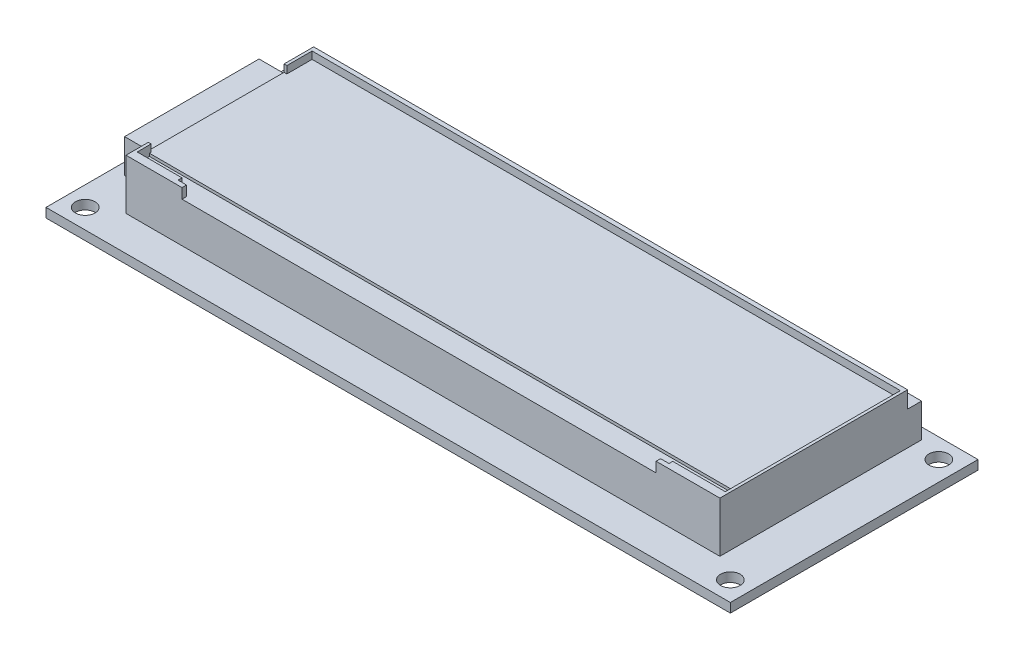
ISO-10303-21;
HEADER;
FILE_DESCRIPTION(('STEP AP214'),'2;1');
FILE_NAME('part.step','',(''),(''),'','','');
FILE_SCHEMA(('AUTOMOTIVE_DESIGN { 1 0 10303 214 1 1 1 1 }'));
ENDSEC;
DATA;
#1=APPLICATION_CONTEXT('core data for automotive mechanical design processes');
#2=APPLICATION_PROTOCOL_DEFINITION('international standard','automotive_design',2000,#1);
#3=PRODUCT_CONTEXT('',#1,'mechanical');
#4=PRODUCT('Part','Part','',(#3));
#5=PRODUCT_RELATED_PRODUCT_CATEGORY('part','',(#4));
#6=PRODUCT_DEFINITION_FORMATION('','',#4);
#7=PRODUCT_DEFINITION_CONTEXT('part definition',#1,'design');
#8=PRODUCT_DEFINITION('design','',#6,#7);
#9=PRODUCT_DEFINITION_SHAPE('','',#8);
#10=(LENGTH_UNIT() NAMED_UNIT(*) SI_UNIT(.MILLI.,.METRE.));
#11=(NAMED_UNIT(*) PLANE_ANGLE_UNIT() SI_UNIT($,.RADIAN.));
#12=(NAMED_UNIT(*) SI_UNIT($,.STERADIAN.) SOLID_ANGLE_UNIT());
#13=UNCERTAINTY_MEASURE_WITH_UNIT(LENGTH_MEASURE(1.E-05),#10,'distance_accuracy_value','');
#14=(GEOMETRIC_REPRESENTATION_CONTEXT(3) GLOBAL_UNCERTAINTY_ASSIGNED_CONTEXT((#13)) GLOBAL_UNIT_ASSIGNED_CONTEXT((#10,
#11,#12)) REPRESENTATION_CONTEXT('',''));
#15=CARTESIAN_POINT('',(0.,0.,0.));
#16=DIRECTION('',(0.,0.,1.));
#17=DIRECTION('',(1.,0.,0.));
#18=AXIS2_PLACEMENT_3D('',#15,#16,#17);
#19=CARTESIAN_POINT('',(0.,1.65,0.));
#20=DIRECTION('',(0.,-1.,0.));
#21=DIRECTION('',(0.,0.,-1.));
#22=AXIS2_PLACEMENT_3D('',#19,#20,#21);
#23=PLANE('',#22);
#24=DIRECTION('',(0.,0.,1.));
#25=VECTOR('',#24,1.);
#26=CARTESIAN_POINT('',(0.,1.65,0.));
#27=LINE('',#26,#25);
#28=CARTESIAN_POINT('',(0.,1.65,-44.2));
#29=VERTEX_POINT('',#28);
#30=CARTESIAN_POINT('',(0.,1.65,0.));
#31=VERTEX_POINT('',#30);
#32=EDGE_CURVE('E586',#29,#31,#27,.T.);
#33=ORIENTED_EDGE('',*,*,#32,.T.);
#34=DIRECTION('',(1.,0.,0.));
#35=VECTOR('',#34,1.);
#36=CARTESIAN_POINT('',(0.,1.65,0.));
#37=LINE('',#36,#35);
#38=CARTESIAN_POINT('',(122.15,1.65,0.));
#39=VERTEX_POINT('',#38);
#40=EDGE_CURVE('E590',#31,#39,#37,.T.);
#41=ORIENTED_EDGE('',*,*,#40,.T.);
#42=DIRECTION('',(0.,0.,-1.));
#43=VECTOR('',#42,1.);
#44=CARTESIAN_POINT('',(122.15,1.65,0.));
#45=LINE('',#44,#43);
#46=CARTESIAN_POINT('',(122.15,1.65,-44.2));
#47=VERTEX_POINT('',#46);
#48=EDGE_CURVE('E594',#39,#47,#45,.T.);
#49=ORIENTED_EDGE('',*,*,#48,.T.);
#50=DIRECTION('',(-1.,0.,0.));
#51=VECTOR('',#50,1.);
#52=CARTESIAN_POINT('',(0.,1.65,-44.2));
#53=LINE('',#52,#51);
#54=EDGE_CURVE('E597',#47,#29,#53,.T.);
#55=ORIENTED_EDGE('',*,*,#54,.T.);
#56=EDGE_LOOP('',(#33,#41,#49,#55));
#57=FACE_BOUND('',#56,.T.);
#58=CARTESIAN_POINT('',(3.5,1.65,-40.7));
#59=DIRECTION('',(0.,1.,0.));
#60=DIRECTION('',(0.,0.,1.));
#61=AXIS2_PLACEMENT_3D('',#58,#59,#60);
#62=CIRCLE('',#61,1.75);
#63=CARTESIAN_POINT('',(3.5,1.65,-38.95));
#64=VERTEX_POINT('',#63);
#65=EDGE_CURVE('E578',#64,#64,#62,.T.);
#66=ORIENTED_EDGE('',*,*,#65,.F.);
#67=EDGE_LOOP('',(#66));
#68=FACE_BOUND('',#67,.T.);
#69=CARTESIAN_POINT('',(3.5,1.65,-3.5));
#70=DIRECTION('',(0.,1.,0.));
#71=DIRECTION('',(0.,0.,-1.));
#72=AXIS2_PLACEMENT_3D('',#69,#70,#71);
#73=CIRCLE('',#72,1.75);
#74=CARTESIAN_POINT('',(3.5,1.65,-5.25));
#75=VERTEX_POINT('',#74);
#76=EDGE_CURVE('E570',#75,#75,#73,.T.);
#77=ORIENTED_EDGE('',*,*,#76,.F.);
#78=EDGE_LOOP('',(#77));
#79=FACE_BOUND('',#78,.T.);
#80=CARTESIAN_POINT('',(118.65,1.65,-3.5));
#81=DIRECTION('',(0.,1.,0.));
#82=DIRECTION('',(0.,0.,1.));
#83=AXIS2_PLACEMENT_3D('',#80,#81,#82);
#84=CIRCLE('',#83,1.75);
#85=CARTESIAN_POINT('',(118.65,1.65,-1.75000000000001));
#86=VERTEX_POINT('',#85);
#87=EDGE_CURVE('E562',#86,#86,#84,.T.);
#88=ORIENTED_EDGE('',*,*,#87,.F.);
#89=EDGE_LOOP('',(#88));
#90=FACE_BOUND('',#89,.T.);
#91=CARTESIAN_POINT('',(118.65,1.65,-40.7));
#92=DIRECTION('',(0.,1.,0.));
#93=DIRECTION('',(0.,0.,-1.));
#94=AXIS2_PLACEMENT_3D('',#91,#92,#93);
#95=CIRCLE('',#94,1.75);
#96=CARTESIAN_POINT('',(118.65,1.65,-42.45));
#97=VERTEX_POINT('',#96);
#98=EDGE_CURVE('E554',#97,#97,#95,.T.);
#99=ORIENTED_EDGE('',*,*,#98,.F.);
#100=EDGE_LOOP('',(#99));
#101=FACE_BOUND('',#100,.T.);
#102=DIRECTION('',(-1.,0.,0.));
#103=VECTOR('',#102,1.);
#104=CARTESIAN_POINT('',(8.07500000000001,1.65,-35.95));
#105=LINE('',#104,#103);
#106=CARTESIAN_POINT('',(8.07500000000001,1.65,-35.95));
#107=VERTEX_POINT('',#106);
#108=CARTESIAN_POINT('',(2.07500000000001,1.65,-35.95));
#109=VERTEX_POINT('',#108);
#110=EDGE_CURVE('E323',#107,#109,#105,.T.);
#111=ORIENTED_EDGE('',*,*,#110,.F.);
#112=DIRECTION('',(0.,0.,1.));
#113=VECTOR('',#112,1.);
#114=CARTESIAN_POINT('',(8.07500000000001,1.65,-42.2));
#115=LINE('',#114,#113);
#116=CARTESIAN_POINT('',(8.07500000000001,1.65,-42.2));
#117=VERTEX_POINT('',#116);
#118=EDGE_CURVE('E524',#117,#107,#115,.T.);
#119=ORIENTED_EDGE('',*,*,#118,.F.);
#120=DIRECTION('',(-1.,0.,0.));
#121=VECTOR('',#120,1.);
#122=CARTESIAN_POINT('',(8.07500000000001,1.65,-42.2));
#123=LINE('',#122,#121);
#124=CARTESIAN_POINT('',(114.075,1.65,-42.2));
#125=VERTEX_POINT('',#124);
#126=EDGE_CURVE('E536',#125,#117,#123,.T.);
#127=ORIENTED_EDGE('',*,*,#126,.F.);
#128=DIRECTION('',(0.,0.,-1.));
#129=VECTOR('',#128,1.);
#130=CARTESIAN_POINT('',(114.075,1.65,-42.2));
#131=LINE('',#130,#129);
#132=CARTESIAN_POINT('',(114.075,1.65,-6.20000000000002));
#133=VERTEX_POINT('',#132);
#134=EDGE_CURVE('E532',#133,#125,#131,.T.);
#135=ORIENTED_EDGE('',*,*,#134,.F.);
#136=DIRECTION('',(1.,0.,0.));
#137=VECTOR('',#136,1.);
#138=CARTESIAN_POINT('',(8.07500000000001,1.65,-6.2));
#139=LINE('',#138,#137);
#140=CARTESIAN_POINT('',(8.07500000000001,1.65,-6.2));
#141=VERTEX_POINT('',#140);
#142=EDGE_CURVE('E528',#141,#133,#139,.T.);
#143=ORIENTED_EDGE('',*,*,#142,.F.);
#144=CARTESIAN_POINT('',(8.07500000000001,1.65,-11.95));
#145=VERTEX_POINT('',#144);
#146=EDGE_CURVE('E506',#145,#141,#115,.T.);
#147=ORIENTED_EDGE('',*,*,#146,.F.);
#148=DIRECTION('',(1.,0.,0.));
#149=VECTOR('',#148,1.);
#150=CARTESIAN_POINT('',(8.07500000000001,1.65,-11.95));
#151=LINE('',#150,#149);
#152=CARTESIAN_POINT('',(2.07500000000001,1.65,-11.95));
#153=VERTEX_POINT('',#152);
#154=EDGE_CURVE('E61',#153,#145,#151,.T.);
#155=ORIENTED_EDGE('',*,*,#154,.F.);
#156=DIRECTION('',(0.,0.,1.));
#157=VECTOR('',#156,1.);
#158=CARTESIAN_POINT('',(2.07500000000001,1.65,-35.95));
#159=LINE('',#158,#157);
#160=EDGE_CURVE('E56',#109,#153,#159,.T.);
#161=ORIENTED_EDGE('',*,*,#160,.F.);
#162=EDGE_LOOP('',(#111,#119,#127,#135,#143,#147,#155,#161));
#163=FACE_BOUND('',#162,.T.);
#164=ADVANCED_FACE('F40',(#57,#68,#79,#90,#101,#163),#23,.F.);
#165=CARTESIAN_POINT('',(8.07500000000001,10.65,-42.2));
#166=DIRECTION('',(1.,0.,0.));
#167=DIRECTION('',(0.,0.,-1.));
#168=AXIS2_PLACEMENT_3D('',#165,#166,#167);
#169=PLANE('',#168);
#170=DIRECTION('',(0.,-1.,0.));
#171=VECTOR('',#170,1.);
#172=CARTESIAN_POINT('',(8.07500000000001,7.65,-35.95));
#173=LINE('',#172,#171);
#174=CARTESIAN_POINT('',(8.07500000000001,7.65,-35.95));
#175=VERTEX_POINT('',#174);
#176=EDGE_CURVE('E357',#175,#107,#173,.T.);
#177=ORIENTED_EDGE('',*,*,#176,.F.);
#178=DIRECTION('',(0.,0.,-1.));
#179=VECTOR('',#178,1.);
#180=CARTESIAN_POINT('',(8.07500000000001,7.65,-35.95));
#181=LINE('',#180,#179);
#182=CARTESIAN_POINT('',(8.07500000000001,7.65,-11.95));
#183=VERTEX_POINT('',#182);
#184=EDGE_CURVE('E326',#183,#175,#181,.T.);
#185=ORIENTED_EDGE('',*,*,#184,.F.);
#186=DIRECTION('',(0.,-1.,0.));
#187=VECTOR('',#186,1.);
#188=CARTESIAN_POINT('',(8.07500000000001,7.65,-11.95));
#189=LINE('',#188,#187);
#190=EDGE_CURVE('E340',#183,#145,#189,.T.);
#191=ORIENTED_EDGE('',*,*,#190,.T.);
#192=ORIENTED_EDGE('',*,*,#146,.T.);
#193=DIRECTION('',(0.,-1.,0.));
#194=VECTOR('',#193,1.);
#195=CARTESIAN_POINT('',(8.07500000000001,10.65,-6.2));
#196=LINE('',#195,#194);
#197=CARTESIAN_POINT('',(8.07500000000001,10.65,-6.2));
#198=VERTEX_POINT('',#197);
#199=EDGE_CURVE('E549',#198,#141,#196,.T.);
#200=ORIENTED_EDGE('',*,*,#199,.F.);
#201=DIRECTION('',(0.,0.,1.));
#202=VECTOR('',#201,1.);
#203=CARTESIAN_POINT('',(8.07500000000001,10.65,-42.2));
#204=LINE('',#203,#202);
#205=CARTESIAN_POINT('',(8.07500000000001,10.65,-10.2));
#206=VERTEX_POINT('',#205);
#207=EDGE_CURVE('E514',#206,#198,#204,.T.);
#208=ORIENTED_EDGE('',*,*,#207,.F.);
#209=DIRECTION('',(0.,1.,0.));
#210=VECTOR('',#209,1.);
#211=CARTESIAN_POINT('',(8.07500000000001,9.35,-10.2));
#212=LINE('',#211,#210);
#213=CARTESIAN_POINT('',(8.07500000000001,9.35,-10.2));
#214=VERTEX_POINT('',#213);
#215=EDGE_CURVE('E475',#214,#206,#212,.T.);
#216=ORIENTED_EDGE('',*,*,#215,.F.);
#217=DIRECTION('',(0.,0.,1.));
#218=VECTOR('',#217,1.);
#219=CARTESIAN_POINT('',(8.07500000000001,9.35,-34.42));
#220=LINE('',#219,#218);
#221=CARTESIAN_POINT('',(8.07500000000001,9.35,-34.42));
#222=VERTEX_POINT('',#221);
#223=EDGE_CURVE('E371',#222,#214,#220,.T.);
#224=ORIENTED_EDGE('',*,*,#223,.F.);
#225=DIRECTION('',(0.,1.,0.));
#226=VECTOR('',#225,1.);
#227=CARTESIAN_POINT('',(8.07500000000001,9.35,-34.42));
#228=LINE('',#227,#226);
#229=CARTESIAN_POINT('',(8.07500000000001,10.65,-34.42));
#230=VERTEX_POINT('',#229);
#231=EDGE_CURVE('E478',#222,#230,#228,.T.);
#232=ORIENTED_EDGE('',*,*,#231,.T.);
#233=CARTESIAN_POINT('',(8.07500000000001,10.65,-39.7));
#234=VERTEX_POINT('',#233);
#235=EDGE_CURVE('E509',#234,#230,#204,.T.);
#236=ORIENTED_EDGE('',*,*,#235,.F.);
#237=DIRECTION('',(0.,1.,0.));
#238=VECTOR('',#237,1.);
#239=CARTESIAN_POINT('',(8.07500000000001,7.65,-39.7));
#240=LINE('',#239,#238);
#241=CARTESIAN_POINT('',(8.07500000000001,7.65,-39.7));
#242=VERTEX_POINT('',#241);
#243=EDGE_CURVE('E499',#242,#234,#240,.T.);
#244=ORIENTED_EDGE('',*,*,#243,.F.);
#245=DIRECTION('',(0.,0.,1.));
#246=VECTOR('',#245,1.);
#247=CARTESIAN_POINT('',(8.075,7.65,-42.2));
#248=LINE('',#247,#246);
#249=CARTESIAN_POINT('',(8.075,7.65,-42.2));
#250=VERTEX_POINT('',#249);
#251=EDGE_CURVE('E485',#250,#242,#248,.T.);
#252=ORIENTED_EDGE('',*,*,#251,.F.);
#253=DIRECTION('',(0.,-1.,0.));
#254=VECTOR('',#253,1.);
#255=CARTESIAN_POINT('',(8.07500000000001,10.65,-42.2));
#256=LINE('',#255,#254);
#257=EDGE_CURVE('E523',#250,#117,#256,.T.);
#258=ORIENTED_EDGE('',*,*,#257,.T.);
#259=ORIENTED_EDGE('',*,*,#118,.T.);
#260=EDGE_LOOP('',(#177,#185,#191,#192,#200,#208,#216,#224,#232,#236,#244,#252,#258,#259));
#261=FACE_BOUND('',#260,.T.);
#262=ADVANCED_FACE('F649',(#261),#169,.F.);
#263=CARTESIAN_POINT('',(0.,10.65,0.));
#264=DIRECTION('',(0.,1.,0.));
#265=DIRECTION('',(0.,0.,1.));
#266=AXIS2_PLACEMENT_3D('',#263,#264,#265);
#267=PLANE('',#266);
#268=DIRECTION('',(0.,0.,1.));
#269=VECTOR('',#268,1.);
#270=CARTESIAN_POINT('',(18.075,10.65,-7.));
#271=LINE('',#270,#269);
#272=CARTESIAN_POINT('',(18.075,10.65,-7.));
#273=VERTEX_POINT('',#272);
#274=CARTESIAN_POINT('',(18.075,10.65,-6.2));
#275=VERTEX_POINT('',#274);
#276=EDGE_CURVE('E413',#273,#275,#271,.T.);
#277=ORIENTED_EDGE('',*,*,#276,.F.);
#278=DIRECTION('',(1.,0.,0.));
#279=VECTOR('',#278,1.);
#280=CARTESIAN_POINT('',(16.575,10.65,-7.));
#281=LINE('',#280,#279);
#282=CARTESIAN_POINT('',(16.575,10.65,-7.));
#283=VERTEX_POINT('',#282);
#284=EDGE_CURVE('E409',#283,#273,#281,.T.);
#285=ORIENTED_EDGE('',*,*,#284,.F.);
#286=DIRECTION('',(0.,0.,1.));
#287=VECTOR('',#286,1.);
#288=CARTESIAN_POINT('',(16.575,10.65,-7.7));
#289=LINE('',#288,#287);
#290=CARTESIAN_POINT('',(16.575,10.65,-7.7));
#291=VERTEX_POINT('',#290);
#292=EDGE_CURVE('E406',#291,#283,#289,.T.);
#293=ORIENTED_EDGE('',*,*,#292,.F.);
#294=DIRECTION('',(1.,0.,0.));
#295=VECTOR('',#294,1.);
#296=CARTESIAN_POINT('',(8.57500000000001,10.65,-7.7));
#297=LINE('',#296,#295);
#298=CARTESIAN_POINT('',(8.57500000000001,10.65,-7.7));
#299=VERTEX_POINT('',#298);
#300=EDGE_CURVE('E256',#299,#291,#297,.T.);
#301=ORIENTED_EDGE('',*,*,#300,.F.);
#302=DIRECTION('',(0.,0.,1.));
#303=VECTOR('',#302,1.);
#304=CARTESIAN_POINT('',(8.57500000000001,10.65,-10.2));
#305=LINE('',#304,#303);
#306=CARTESIAN_POINT('',(8.57500000000001,10.65,-10.2));
#307=VERTEX_POINT('',#306);
#308=EDGE_CURVE('E400',#307,#299,#305,.T.);
#309=ORIENTED_EDGE('',*,*,#308,.F.);
#310=DIRECTION('',(1.,0.,0.));
#311=VECTOR('',#310,1.);
#312=CARTESIAN_POINT('',(8.07500000000001,10.65,-10.2));
#313=LINE('',#312,#311);
#314=EDGE_CURVE('E396',#206,#307,#313,.T.);
#315=ORIENTED_EDGE('',*,*,#314,.F.);
#316=ORIENTED_EDGE('',*,*,#207,.T.);
#317=DIRECTION('',(1.,0.,0.));
#318=VECTOR('',#317,1.);
#319=CARTESIAN_POINT('',(8.07500000000001,10.65,-6.2));
#320=LINE('',#319,#318);
#321=EDGE_CURVE('E515',#198,#275,#320,.T.);
#322=ORIENTED_EDGE('',*,*,#321,.T.);
#323=EDGE_LOOP('',(#277,#285,#293,#301,#309,#315,#316,#322));
#324=FACE_BOUND('',#323,.T.);
#325=ADVANCED_FACE('F654',(#324),#267,.T.);
#326=CARTESIAN_POINT('',(8.07500000000001,10.65,-42.2));
#327=DIRECTION('',(0.,0.,1.));
#328=DIRECTION('',(1.,0.,0.));
#329=AXIS2_PLACEMENT_3D('',#326,#327,#328);
#330=PLANE('',#329);
#331=DIRECTION('',(-1.,0.,0.));
#332=VECTOR('',#331,1.);
#333=CARTESIAN_POINT('',(8.075,7.65,-42.2));
#334=LINE('',#333,#332);
#335=CARTESIAN_POINT('',(114.075,7.65,-42.2));
#336=VERTEX_POINT('',#335);
#337=EDGE_CURVE('E496',#336,#250,#334,.T.);
#338=ORIENTED_EDGE('',*,*,#337,.F.);
#339=DIRECTION('',(0.,-1.,0.));
#340=VECTOR('',#339,1.);
#341=CARTESIAN_POINT('',(114.075,10.65,-42.2));
#342=LINE('',#341,#340);
#343=EDGE_CURVE('E542',#336,#125,#342,.T.);
#344=ORIENTED_EDGE('',*,*,#343,.T.);
#345=ORIENTED_EDGE('',*,*,#126,.T.);
#346=ORIENTED_EDGE('',*,*,#257,.F.);
#347=EDGE_LOOP('',(#338,#344,#345,#346));
#348=FACE_BOUND('',#347,.T.);
#349=ADVANCED_FACE('F663',(#348),#330,.F.);
#350=CARTESIAN_POINT('',(0.,0.,0.));
#351=DIRECTION('',(0.,-1.,0.));
#352=DIRECTION('',(0.,0.,-1.));
#353=AXIS2_PLACEMENT_3D('',#350,#351,#352);
#354=PLANE('',#353);
#355=CARTESIAN_POINT('',(118.65,0.,-3.5));
#356=DIRECTION('',(0.,1.,0.));
#357=DIRECTION('',(0.,0.,1.));
#358=AXIS2_PLACEMENT_3D('',#355,#356,#357);
#359=CIRCLE('',#358,1.75);
#360=CARTESIAN_POINT('',(118.65,0.,-1.75000000000001));
#361=VERTEX_POINT('',#360);
#362=EDGE_CURVE('E558',#361,#361,#359,.T.);
#363=ORIENTED_EDGE('',*,*,#362,.T.);
#364=EDGE_LOOP('',(#363));
#365=FACE_BOUND('',#364,.T.);
#366=CARTESIAN_POINT('',(3.5,0.,-40.7));
#367=DIRECTION('',(0.,1.,0.));
#368=DIRECTION('',(0.,0.,1.));
#369=AXIS2_PLACEMENT_3D('',#366,#367,#368);
#370=CIRCLE('',#369,1.75);
#371=CARTESIAN_POINT('',(3.5,0.,-38.95));
#372=VERTEX_POINT('',#371);
#373=EDGE_CURVE('E574',#372,#372,#370,.T.);
#374=ORIENTED_EDGE('',*,*,#373,.T.);
#375=EDGE_LOOP('',(#374));
#376=FACE_BOUND('',#375,.T.);
#377=DIRECTION('',(0.,0.,1.));
#378=VECTOR('',#377,1.);
#379=CARTESIAN_POINT('',(0.,0.,0.));
#380=LINE('',#379,#378);
#381=CARTESIAN_POINT('',(0.,0.,-44.2));
#382=VERTEX_POINT('',#381);
#383=CARTESIAN_POINT('',(0.,0.,0.));
#384=VERTEX_POINT('',#383);
#385=EDGE_CURVE('E582',#382,#384,#380,.T.);
#386=ORIENTED_EDGE('',*,*,#385,.F.);
#387=DIRECTION('',(-1.,0.,0.));
#388=VECTOR('',#387,1.);
#389=CARTESIAN_POINT('',(0.,0.,-44.2));
#390=LINE('',#389,#388);
#391=CARTESIAN_POINT('',(122.15,0.,-44.2));
#392=VERTEX_POINT('',#391);
#393=EDGE_CURVE('E591',#392,#382,#390,.T.);
#394=ORIENTED_EDGE('',*,*,#393,.F.);
#395=DIRECTION('',(0.,0.,-1.));
#396=VECTOR('',#395,1.);
#397=CARTESIAN_POINT('',(122.15,0.,0.));
#398=LINE('',#397,#396);
#399=CARTESIAN_POINT('',(122.15,0.,0.));
#400=VERTEX_POINT('',#399);
#401=EDGE_CURVE('E607',#400,#392,#398,.T.);
#402=ORIENTED_EDGE('',*,*,#401,.F.);
#403=DIRECTION('',(1.,0.,0.));
#404=VECTOR('',#403,1.);
#405=CARTESIAN_POINT('',(0.,0.,0.));
#406=LINE('',#405,#404);
#407=EDGE_CURVE('E604',#384,#400,#406,.T.);
#408=ORIENTED_EDGE('',*,*,#407,.F.);
#409=EDGE_LOOP('',(#386,#394,#402,#408));
#410=FACE_BOUND('',#409,.T.);
#411=CARTESIAN_POINT('',(3.5,0.,-3.5));
#412=DIRECTION('',(0.,1.,0.));
#413=DIRECTION('',(0.,0.,-1.));
#414=AXIS2_PLACEMENT_3D('',#411,#412,#413);
#415=CIRCLE('',#414,1.75);
#416=CARTESIAN_POINT('',(3.5,0.,-5.25));
#417=VERTEX_POINT('',#416);
#418=EDGE_CURVE('E566',#417,#417,#415,.T.);
#419=ORIENTED_EDGE('',*,*,#418,.T.);
#420=EDGE_LOOP('',(#419));
#421=FACE_BOUND('',#420,.T.);
#422=CARTESIAN_POINT('',(118.65,0.,-40.7));
#423=DIRECTION('',(0.,1.,0.));
#424=DIRECTION('',(0.,0.,-1.));
#425=AXIS2_PLACEMENT_3D('',#422,#423,#424);
#426=CIRCLE('',#425,1.75);
#427=CARTESIAN_POINT('',(118.65,0.,-42.45));
#428=VERTEX_POINT('',#427);
#429=EDGE_CURVE('E553',#428,#428,#426,.T.);
#430=ORIENTED_EDGE('',*,*,#429,.T.);
#431=EDGE_LOOP('',(#430));
#432=FACE_BOUND('',#431,.T.);
#433=ADVANCED_FACE('F630',(#365,#376,#410,#421,#432),#354,.T.);
#434=CARTESIAN_POINT('',(0.,1.65,0.));
#435=DIRECTION('',(1.,0.,0.));
#436=DIRECTION('',(0.,0.,-1.));
#437=AXIS2_PLACEMENT_3D('',#434,#435,#436);
#438=PLANE('',#437);
#439=ORIENTED_EDGE('',*,*,#385,.T.);
#440=DIRECTION('',(0.,-1.,0.));
#441=VECTOR('',#440,1.);
#442=CARTESIAN_POINT('',(0.,1.65,0.));
#443=LINE('',#442,#441);
#444=EDGE_CURVE('E11',#31,#384,#443,.T.);
#445=ORIENTED_EDGE('',*,*,#444,.F.);
#446=ORIENTED_EDGE('',*,*,#32,.F.);
#447=DIRECTION('',(0.,-1.,0.));
#448=VECTOR('',#447,1.);
#449=CARTESIAN_POINT('',(0.,1.65,-44.2));
#450=LINE('',#449,#448);
#451=EDGE_CURVE('E600',#29,#382,#450,.T.);
#452=ORIENTED_EDGE('',*,*,#451,.T.);
#453=EDGE_LOOP('',(#439,#445,#446,#452));
#454=FACE_BOUND('',#453,.T.);
#455=ADVANCED_FACE('F42',(#454),#438,.F.);
#456=CARTESIAN_POINT('',(0.,1.65,0.));
#457=DIRECTION('',(0.,0.,-1.));
#458=DIRECTION('',(-1.,0.,0.));
#459=AXIS2_PLACEMENT_3D('',#456,#457,#458);
#460=PLANE('',#459);
#461=ORIENTED_EDGE('',*,*,#407,.T.);
#462=DIRECTION('',(0.,-1.,0.));
#463=VECTOR('',#462,1.);
#464=CARTESIAN_POINT('',(122.15,1.65,0.));
#465=LINE('',#464,#463);
#466=EDGE_CURVE('E49',#39,#400,#465,.T.);
#467=ORIENTED_EDGE('',*,*,#466,.F.);
#468=ORIENTED_EDGE('',*,*,#40,.F.);
#469=ORIENTED_EDGE('',*,*,#444,.T.);
#470=EDGE_LOOP('',(#461,#467,#468,#469));
#471=FACE_BOUND('',#470,.T.);
#472=ADVANCED_FACE('F641',(#471),#460,.F.);
#473=CARTESIAN_POINT('',(122.15,1.65,0.));
#474=DIRECTION('',(-1.,0.,0.));
#475=DIRECTION('',(0.,0.,1.));
#476=AXIS2_PLACEMENT_3D('',#473,#474,#475);
#477=PLANE('',#476);
#478=ORIENTED_EDGE('',*,*,#401,.T.);
#479=DIRECTION('',(0.,-1.,0.));
#480=VECTOR('',#479,1.);
#481=CARTESIAN_POINT('',(122.15,1.65,-44.2));
#482=LINE('',#481,#480);
#483=EDGE_CURVE('E615',#47,#392,#482,.T.);
#484=ORIENTED_EDGE('',*,*,#483,.F.);
#485=ORIENTED_EDGE('',*,*,#48,.F.);
#486=ORIENTED_EDGE('',*,*,#466,.T.);
#487=EDGE_LOOP('',(#478,#484,#485,#486));
#488=FACE_BOUND('',#487,.T.);
#489=ADVANCED_FACE('F624',(#488),#477,.F.);
#490=CARTESIAN_POINT('',(0.,1.65,-44.2));
#491=DIRECTION('',(0.,0.,1.));
#492=DIRECTION('',(1.,0.,0.));
#493=AXIS2_PLACEMENT_3D('',#490,#491,#492);
#494=PLANE('',#493);
#495=ORIENTED_EDGE('',*,*,#393,.T.);
#496=ORIENTED_EDGE('',*,*,#451,.F.);
#497=ORIENTED_EDGE('',*,*,#54,.F.);
#498=ORIENTED_EDGE('',*,*,#483,.T.);
#499=EDGE_LOOP('',(#495,#496,#497,#498));
#500=FACE_BOUND('',#499,.T.);
#501=ADVANCED_FACE('F634',(#500),#494,.F.);
#502=CARTESIAN_POINT('',(3.5,1.65,-40.7));
#503=DIRECTION('',(0.,-1.,0.));
#504=DIRECTION('',(0.,0.,-1.));
#505=AXIS2_PLACEMENT_3D('',#502,#503,#504);
#506=CYLINDRICAL_SURFACE('',#505,1.75);
#507=ORIENTED_EDGE('',*,*,#65,.T.);
#508=EDGE_LOOP('',(#507));
#509=FACE_BOUND('',#508,.T.);
#510=ORIENTED_EDGE('',*,*,#373,.F.);
#511=EDGE_LOOP('',(#510));
#512=FACE_BOUND('',#511,.T.);
#513=ADVANCED_FACE('F659',(#509,#512),#506,.F.);
#514=CARTESIAN_POINT('',(3.5,1.65,-3.5));
#515=DIRECTION('',(0.,-1.,0.));
#516=DIRECTION('',(0.,0.,-1.));
#517=AXIS2_PLACEMENT_3D('',#514,#515,#516);
#518=CYLINDRICAL_SURFACE('',#517,1.75);
#519=ORIENTED_EDGE('',*,*,#76,.T.);
#520=EDGE_LOOP('',(#519));
#521=FACE_BOUND('',#520,.T.);
#522=ORIENTED_EDGE('',*,*,#418,.F.);
#523=EDGE_LOOP('',(#522));
#524=FACE_BOUND('',#523,.T.);
#525=ADVANCED_FACE('F669',(#521,#524),#518,.F.);
#526=CARTESIAN_POINT('',(118.65,1.65,-3.5));
#527=DIRECTION('',(0.,-1.,0.));
#528=DIRECTION('',(0.,0.,-1.));
#529=AXIS2_PLACEMENT_3D('',#526,#527,#528);
#530=CYLINDRICAL_SURFACE('',#529,1.75);
#531=ORIENTED_EDGE('',*,*,#87,.T.);
#532=EDGE_LOOP('',(#531));
#533=FACE_BOUND('',#532,.T.);
#534=ORIENTED_EDGE('',*,*,#362,.F.);
#535=EDGE_LOOP('',(#534));
#536=FACE_BOUND('',#535,.T.);
#537=ADVANCED_FACE('F674',(#533,#536),#530,.F.);
#538=CARTESIAN_POINT('',(118.65,1.65,-40.7));
#539=DIRECTION('',(0.,-1.,0.));
#540=DIRECTION('',(0.,0.,-1.));
#541=AXIS2_PLACEMENT_3D('',#538,#539,#540);
#542=CYLINDRICAL_SURFACE('',#541,1.75);
#543=ORIENTED_EDGE('',*,*,#98,.T.);
#544=EDGE_LOOP('',(#543));
#545=FACE_BOUND('',#544,.T.);
#546=ORIENTED_EDGE('',*,*,#429,.F.);
#547=EDGE_LOOP('',(#546));
#548=FACE_BOUND('',#547,.T.);
#549=ADVANCED_FACE('F794',(#545,#548),#542,.F.);
#550=CARTESIAN_POINT('',(8.07500000000001,10.65,-6.2));
#551=DIRECTION('',(0.,0.,-1.));
#552=DIRECTION('',(-1.,0.,0.));
#553=AXIS2_PLACEMENT_3D('',#550,#551,#552);
#554=PLANE('',#553);
#555=DIRECTION('',(0.,1.,0.));
#556=VECTOR('',#555,1.);
#557=CARTESIAN_POINT('',(102.689654610399,9.35,-6.2));
#558=LINE('',#557,#556);
#559=CARTESIAN_POINT('',(102.689654610399,8.85,-6.2));
#560=VERTEX_POINT('',#559);
#561=CARTESIAN_POINT('',(102.689654610399,10.65,-6.2));
#562=VERTEX_POINT('',#561);
#563=EDGE_CURVE('E458',#560,#562,#558,.T.);
#564=ORIENTED_EDGE('',*,*,#563,.F.);
#565=DIRECTION('',(1.,0.,0.));
#566=VECTOR('',#565,1.);
#567=CARTESIAN_POINT('',(18.075,8.85,-6.2));
#568=LINE('',#567,#566);
#569=CARTESIAN_POINT('',(18.075,8.85,-6.2));
#570=VERTEX_POINT('',#569);
#571=EDGE_CURVE('E290',#570,#560,#568,.T.);
#572=ORIENTED_EDGE('',*,*,#571,.F.);
#573=DIRECTION('',(0.,1.,0.));
#574=VECTOR('',#573,1.);
#575=CARTESIAN_POINT('',(18.075,9.35,-6.2));
#576=LINE('',#575,#574);
#577=EDGE_CURVE('E461',#570,#275,#576,.T.);
#578=ORIENTED_EDGE('',*,*,#577,.T.);
#579=ORIENTED_EDGE('',*,*,#321,.F.);
#580=ORIENTED_EDGE('',*,*,#199,.T.);
#581=ORIENTED_EDGE('',*,*,#142,.T.);
#582=DIRECTION('',(0.,-1.,0.));
#583=VECTOR('',#582,1.);
#584=CARTESIAN_POINT('',(114.075,10.65,-6.20000000000002));
#585=LINE('',#584,#583);
#586=CARTESIAN_POINT('',(114.075,10.65,-6.20000000000002));
#587=VERTEX_POINT('',#586);
#588=EDGE_CURVE('E545',#587,#133,#585,.T.);
#589=ORIENTED_EDGE('',*,*,#588,.F.);
#590=EDGE_CURVE('E513',#562,#587,#320,.T.);
#591=ORIENTED_EDGE('',*,*,#590,.F.);
#592=EDGE_LOOP('',(#564,#572,#578,#579,#580,#581,#589,#591));
#593=FACE_BOUND('',#592,.T.);
#594=ADVANCED_FACE('F791',(#593),#554,.F.);
#595=CARTESIAN_POINT('',(114.075,10.65,-42.2));
#596=DIRECTION('',(-1.,0.,0.));
#597=DIRECTION('',(0.,0.,1.));
#598=AXIS2_PLACEMENT_3D('',#595,#596,#597);
#599=PLANE('',#598);
#600=DIRECTION('',(0.,0.,-1.));
#601=VECTOR('',#600,1.);
#602=CARTESIAN_POINT('',(114.075,7.65,-42.2));
#603=LINE('',#602,#601);
#604=CARTESIAN_POINT('',(114.075,7.65,-39.7));
#605=VERTEX_POINT('',#604);
#606=EDGE_CURVE('E493',#605,#336,#603,.T.);
#607=ORIENTED_EDGE('',*,*,#606,.F.);
#608=DIRECTION('',(0.,1.,0.));
#609=VECTOR('',#608,1.);
#610=CARTESIAN_POINT('',(114.075,7.65,-39.7));
#611=LINE('',#610,#609);
#612=CARTESIAN_POINT('',(114.075,10.65,-39.7));
#613=VERTEX_POINT('',#612);
#614=EDGE_CURVE('E502',#605,#613,#611,.T.);
#615=ORIENTED_EDGE('',*,*,#614,.T.);
#616=DIRECTION('',(0.,0.,-1.));
#617=VECTOR('',#616,1.);
#618=CARTESIAN_POINT('',(114.075,10.65,-42.2));
#619=LINE('',#618,#617);
#620=EDGE_CURVE('E519',#587,#613,#619,.T.);
#621=ORIENTED_EDGE('',*,*,#620,.F.);
#622=ORIENTED_EDGE('',*,*,#588,.T.);
#623=ORIENTED_EDGE('',*,*,#134,.T.);
#624=ORIENTED_EDGE('',*,*,#343,.F.);
#625=EDGE_LOOP('',(#607,#615,#621,#622,#623,#624));
#626=FACE_BOUND('',#625,.T.);
#627=ADVANCED_FACE('F784',(#626),#599,.F.);
#628=DIRECTION('',(0.,0.,-1.));
#629=VECTOR('',#628,1.);
#630=CARTESIAN_POINT('',(102.689654610399,10.65,-6.2));
#631=LINE('',#630,#629);
#632=CARTESIAN_POINT('',(102.689654610399,10.65,-7.));
#633=VERTEX_POINT('',#632);
#634=EDGE_CURVE('E416',#562,#633,#631,.T.);
#635=ORIENTED_EDGE('',*,*,#634,.F.);
#636=ORIENTED_EDGE('',*,*,#590,.T.);
#637=ORIENTED_EDGE('',*,*,#620,.T.);
#638=DIRECTION('',(1.,0.,0.));
#639=VECTOR('',#638,1.);
#640=CARTESIAN_POINT('',(8.07500000000001,10.65,-39.7));
#641=LINE('',#640,#639);
#642=EDGE_CURVE('E442',#234,#613,#641,.T.);
#643=ORIENTED_EDGE('',*,*,#642,.F.);
#644=ORIENTED_EDGE('',*,*,#235,.T.);
#645=DIRECTION('',(-1.,0.,0.));
#646=VECTOR('',#645,1.);
#647=CARTESIAN_POINT('',(8.575,10.65,-34.42));
#648=LINE('',#647,#646);
#649=CARTESIAN_POINT('',(8.575,10.65,-34.42));
#650=VERTEX_POINT('',#649);
#651=EDGE_CURVE('E393',#650,#230,#648,.T.);
#652=ORIENTED_EDGE('',*,*,#651,.F.);
#653=DIRECTION('',(0.,0.,1.));
#654=VECTOR('',#653,1.);
#655=CARTESIAN_POINT('',(8.575,10.65,-38.92));
#656=LINE('',#655,#654);
#657=CARTESIAN_POINT('',(8.575,10.65,-38.92));
#658=VERTEX_POINT('',#657);
#659=EDGE_CURVE('E361',#658,#650,#656,.T.);
#660=ORIENTED_EDGE('',*,*,#659,.F.);
#661=DIRECTION('',(-1.,0.,0.));
#662=VECTOR('',#661,1.);
#663=CARTESIAN_POINT('',(8.575,10.65,-38.92));
#664=LINE('',#663,#662);
#665=CARTESIAN_POINT('',(113.575,10.65,-38.92));
#666=VERTEX_POINT('',#665);
#667=EDGE_CURVE('E367',#666,#658,#664,.T.);
#668=ORIENTED_EDGE('',*,*,#667,.F.);
#669=DIRECTION('',(0.,0.,-1.));
#670=VECTOR('',#669,1.);
#671=CARTESIAN_POINT('',(113.575,10.65,-38.92));
#672=LINE('',#671,#670);
#673=CARTESIAN_POINT('',(113.575,10.65,-7.67210311892263));
#674=VERTEX_POINT('',#673);
#675=EDGE_CURVE('E432',#674,#666,#672,.T.);
#676=ORIENTED_EDGE('',*,*,#675,.F.);
#677=DIRECTION('',(1.,0.,0.));
#678=VECTOR('',#677,1.);
#679=CARTESIAN_POINT('',(104.189654610399,10.65,-7.67210311892263));
#680=LINE('',#679,#678);
#681=CARTESIAN_POINT('',(104.189654610399,10.65,-7.67210311892263));
#682=VERTEX_POINT('',#681);
#683=EDGE_CURVE('E428',#682,#674,#680,.T.);
#684=ORIENTED_EDGE('',*,*,#683,.F.);
#685=DIRECTION('',(0.,0.,-1.));
#686=VECTOR('',#685,1.);
#687=CARTESIAN_POINT('',(104.189654610399,10.65,-7.));
#688=LINE('',#687,#686);
#689=CARTESIAN_POINT('',(104.189654610399,10.65,-7.));
#690=VERTEX_POINT('',#689);
#691=EDGE_CURVE('E424',#690,#682,#688,.T.);
#692=ORIENTED_EDGE('',*,*,#691,.F.);
#693=DIRECTION('',(1.,0.,0.));
#694=VECTOR('',#693,1.);
#695=CARTESIAN_POINT('',(102.689654610399,10.65,-7.));
#696=LINE('',#695,#694);
#697=EDGE_CURVE('E420',#633,#690,#696,.T.);
#698=ORIENTED_EDGE('',*,*,#697,.F.);
#699=EDGE_LOOP('',(#635,#636,#637,#643,#644,#652,#660,#668,#676,#684,#692,#698));
#700=FACE_BOUND('',#699,.T.);
#701=ADVANCED_FACE('F780',(#700),#267,.T.);
#702=CARTESIAN_POINT('',(8.07500000000001,7.65,-39.7));
#703=DIRECTION('',(0.,0.,1.));
#704=DIRECTION('',(1.,0.,0.));
#705=AXIS2_PLACEMENT_3D('',#702,#703,#704);
#706=PLANE('',#705);
#707=ORIENTED_EDGE('',*,*,#642,.T.);
#708=ORIENTED_EDGE('',*,*,#614,.F.);
#709=DIRECTION('',(1.,0.,0.));
#710=VECTOR('',#709,1.);
#711=CARTESIAN_POINT('',(8.07500000000001,7.65,-39.7));
#712=LINE('',#711,#710);
#713=EDGE_CURVE('E489',#242,#605,#712,.T.);
#714=ORIENTED_EDGE('',*,*,#713,.F.);
#715=ORIENTED_EDGE('',*,*,#243,.T.);
#716=EDGE_LOOP('',(#707,#708,#714,#715));
#717=FACE_BOUND('',#716,.T.);
#718=ADVANCED_FACE('F776',(#717),#706,.F.);
#719=CARTESIAN_POINT('',(0.,7.65,0.));
#720=DIRECTION('',(0.,1.,0.));
#721=DIRECTION('',(0.,0.,1.));
#722=AXIS2_PLACEMENT_3D('',#719,#720,#721);
#723=PLANE('',#722);
#724=ORIENTED_EDGE('',*,*,#251,.T.);
#725=ORIENTED_EDGE('',*,*,#713,.T.);
#726=ORIENTED_EDGE('',*,*,#606,.T.);
#727=ORIENTED_EDGE('',*,*,#337,.T.);
#728=EDGE_LOOP('',(#724,#725,#726,#727));
#729=FACE_BOUND('',#728,.T.);
#730=ADVANCED_FACE('F772',(#729),#723,.T.);
#731=CARTESIAN_POINT('',(8.575,9.35,-38.92));
#732=DIRECTION('',(-1.,0.,0.));
#733=DIRECTION('',(0.,0.,1.));
#734=AXIS2_PLACEMENT_3D('',#731,#732,#733);
#735=PLANE('',#734);
#736=ORIENTED_EDGE('',*,*,#659,.T.);
#737=DIRECTION('',(0.,1.,0.));
#738=VECTOR('',#737,1.);
#739=CARTESIAN_POINT('',(8.575,9.35,-34.42));
#740=LINE('',#739,#738);
#741=CARTESIAN_POINT('',(8.575,9.35,-34.42));
#742=VERTEX_POINT('',#741);
#743=EDGE_CURVE('E390',#742,#650,#740,.T.);
#744=ORIENTED_EDGE('',*,*,#743,.F.);
#745=DIRECTION('',(0.,0.,1.));
#746=VECTOR('',#745,1.);
#747=CARTESIAN_POINT('',(8.575,9.35,-38.92));
#748=LINE('',#747,#746);
#749=CARTESIAN_POINT('',(8.575,9.35,-38.92));
#750=VERTEX_POINT('',#749);
#751=EDGE_CURVE('E362',#750,#742,#748,.T.);
#752=ORIENTED_EDGE('',*,*,#751,.F.);
#753=DIRECTION('',(0.,1.,0.));
#754=VECTOR('',#753,1.);
#755=CARTESIAN_POINT('',(8.575,9.35,-38.92));
#756=LINE('',#755,#754);
#757=EDGE_CURVE('E439',#750,#658,#756,.T.);
#758=ORIENTED_EDGE('',*,*,#757,.T.);
#759=EDGE_LOOP('',(#736,#744,#752,#758));
#760=FACE_BOUND('',#759,.T.);
#761=ADVANCED_FACE('F726',(#760),#735,.F.);
#762=CARTESIAN_POINT('',(8.575,9.35,-38.92));
#763=DIRECTION('',(0.,0.,-1.));
#764=DIRECTION('',(-1.,0.,0.));
#765=AXIS2_PLACEMENT_3D('',#762,#763,#764);
#766=PLANE('',#765);
#767=ORIENTED_EDGE('',*,*,#667,.T.);
#768=ORIENTED_EDGE('',*,*,#757,.F.);
#769=DIRECTION('',(-1.,0.,0.));
#770=VECTOR('',#769,1.);
#771=CARTESIAN_POINT('',(8.575,9.35,-38.92));
#772=LINE('',#771,#770);
#773=CARTESIAN_POINT('',(113.575,9.35,-38.92));
#774=VERTEX_POINT('',#773);
#775=EDGE_CURVE('E386',#774,#750,#772,.T.);
#776=ORIENTED_EDGE('',*,*,#775,.F.);
#777=DIRECTION('',(0.,1.,0.));
#778=VECTOR('',#777,1.);
#779=CARTESIAN_POINT('',(113.575,9.35,-38.92));
#780=LINE('',#779,#778);
#781=EDGE_CURVE('E443',#774,#666,#780,.T.);
#782=ORIENTED_EDGE('',*,*,#781,.T.);
#783=EDGE_LOOP('',(#767,#768,#776,#782));
#784=FACE_BOUND('',#783,.T.);
#785=ADVANCED_FACE('F722',(#784),#766,.F.);
#786=CARTESIAN_POINT('',(113.575,9.35,-38.92));
#787=DIRECTION('',(1.,0.,0.));
#788=DIRECTION('',(0.,0.,-1.));
#789=AXIS2_PLACEMENT_3D('',#786,#787,#788);
#790=PLANE('',#789);
#791=ORIENTED_EDGE('',*,*,#675,.T.);
#792=ORIENTED_EDGE('',*,*,#781,.F.);
#793=DIRECTION('',(0.,0.,-1.));
#794=VECTOR('',#793,1.);
#795=CARTESIAN_POINT('',(113.575,9.35,-38.92));
#796=LINE('',#795,#794);
#797=CARTESIAN_POINT('',(113.575,9.35,-9.9));
#798=VERTEX_POINT('',#797);
#799=EDGE_CURVE('E383',#798,#774,#796,.T.);
#800=ORIENTED_EDGE('',*,*,#799,.F.);
#801=DIRECTION('',(0.,1.,0.));
#802=VECTOR('',#801,1.);
#803=CARTESIAN_POINT('',(113.575,8.85,-9.9));
#804=LINE('',#803,#802);
#805=CARTESIAN_POINT('',(113.575,8.85,-9.9));
#806=VERTEX_POINT('',#805);
#807=EDGE_CURVE('E318',#806,#798,#804,.T.);
#808=ORIENTED_EDGE('',*,*,#807,.F.);
#809=DIRECTION('',(0.,0.,-1.));
#810=VECTOR('',#809,1.);
#811=CARTESIAN_POINT('',(113.575,8.85,-7.67210311892263));
#812=LINE('',#811,#810);
#813=CARTESIAN_POINT('',(113.575,8.85,-7.67210311892263));
#814=VERTEX_POINT('',#813);
#815=EDGE_CURVE('E310',#814,#806,#812,.T.);
#816=ORIENTED_EDGE('',*,*,#815,.F.);
#817=DIRECTION('',(0.,1.,0.));
#818=VECTOR('',#817,1.);
#819=CARTESIAN_POINT('',(113.575,9.35,-7.67210311892263));
#820=LINE('',#819,#818);
#821=EDGE_CURVE('E446',#814,#674,#820,.T.);
#822=ORIENTED_EDGE('',*,*,#821,.T.);
#823=EDGE_LOOP('',(#791,#792,#800,#808,#816,#822));
#824=FACE_BOUND('',#823,.T.);
#825=ADVANCED_FACE('F725',(#824),#790,.F.);
#826=CARTESIAN_POINT('',(104.189654610399,9.35,-7.67210311892263));
#827=DIRECTION('',(0.,0.,1.));
#828=DIRECTION('',(1.,0.,0.));
#829=AXIS2_PLACEMENT_3D('',#826,#827,#828);
#830=PLANE('',#829);
#831=ORIENTED_EDGE('',*,*,#683,.T.);
#832=ORIENTED_EDGE('',*,*,#821,.F.);
#833=DIRECTION('',(1.,0.,0.));
#834=VECTOR('',#833,1.);
#835=CARTESIAN_POINT('',(104.189654610399,8.85,-7.67210311892263));
#836=LINE('',#835,#834);
#837=CARTESIAN_POINT('',(104.189654610399,8.85,-7.67210311892263));
#838=VERTEX_POINT('',#837);
#839=EDGE_CURVE('E306',#838,#814,#836,.T.);
#840=ORIENTED_EDGE('',*,*,#839,.F.);
#841=DIRECTION('',(0.,1.,0.));
#842=VECTOR('',#841,1.);
#843=CARTESIAN_POINT('',(104.189654610399,9.35,-7.67210311892263));
#844=LINE('',#843,#842);
#845=EDGE_CURVE('E449',#838,#682,#844,.T.);
#846=ORIENTED_EDGE('',*,*,#845,.T.);
#847=EDGE_LOOP('',(#831,#832,#840,#846));
#848=FACE_BOUND('',#847,.T.);
#849=ADVANCED_FACE('F730',(#848),#830,.F.);
#850=CARTESIAN_POINT('',(104.189654610399,9.35,-7.));
#851=DIRECTION('',(1.,0.,0.));
#852=DIRECTION('',(0.,0.,-1.));
#853=AXIS2_PLACEMENT_3D('',#850,#851,#852);
#854=PLANE('',#853);
#855=ORIENTED_EDGE('',*,*,#691,.T.);
#856=ORIENTED_EDGE('',*,*,#845,.F.);
#857=DIRECTION('',(0.,0.,-1.));
#858=VECTOR('',#857,1.);
#859=CARTESIAN_POINT('',(104.189654610399,8.85,-7.));
#860=LINE('',#859,#858);
#861=CARTESIAN_POINT('',(104.189654610399,8.85,-7.));
#862=VERTEX_POINT('',#861);
#863=EDGE_CURVE('E302',#862,#838,#860,.T.);
#864=ORIENTED_EDGE('',*,*,#863,.F.);
#865=DIRECTION('',(0.,1.,0.));
#866=VECTOR('',#865,1.);
#867=CARTESIAN_POINT('',(104.189654610399,9.35,-7.));
#868=LINE('',#867,#866);
#869=EDGE_CURVE('E452',#862,#690,#868,.T.);
#870=ORIENTED_EDGE('',*,*,#869,.T.);
#871=EDGE_LOOP('',(#855,#856,#864,#870));
#872=FACE_BOUND('',#871,.T.);
#873=ADVANCED_FACE('F734',(#872),#854,.F.);
#874=CARTESIAN_POINT('',(102.689654610399,9.35,-7.));
#875=DIRECTION('',(0.,0.,1.));
#876=DIRECTION('',(1.,0.,0.));
#877=AXIS2_PLACEMENT_3D('',#874,#875,#876);
#878=PLANE('',#877);
#879=ORIENTED_EDGE('',*,*,#697,.T.);
#880=ORIENTED_EDGE('',*,*,#869,.F.);
#881=DIRECTION('',(1.,0.,0.));
#882=VECTOR('',#881,1.);
#883=CARTESIAN_POINT('',(102.689654610399,8.85,-7.));
#884=LINE('',#883,#882);
#885=CARTESIAN_POINT('',(102.689654610399,8.85,-7.));
#886=VERTEX_POINT('',#885);
#887=EDGE_CURVE('E298',#886,#862,#884,.T.);
#888=ORIENTED_EDGE('',*,*,#887,.F.);
#889=DIRECTION('',(0.,1.,0.));
#890=VECTOR('',#889,1.);
#891=CARTESIAN_POINT('',(102.689654610399,9.35,-7.));
#892=LINE('',#891,#890);
#893=EDGE_CURVE('E455',#886,#633,#892,.T.);
#894=ORIENTED_EDGE('',*,*,#893,.T.);
#895=EDGE_LOOP('',(#879,#880,#888,#894));
#896=FACE_BOUND('',#895,.T.);
#897=ADVANCED_FACE('F738',(#896),#878,.F.);
#898=CARTESIAN_POINT('',(102.689654610399,9.35,-6.2));
#899=DIRECTION('',(1.,0.,0.));
#900=DIRECTION('',(0.,0.,-1.));
#901=AXIS2_PLACEMENT_3D('',#898,#899,#900);
#902=PLANE('',#901);
#903=ORIENTED_EDGE('',*,*,#634,.T.);
#904=ORIENTED_EDGE('',*,*,#893,.F.);
#905=DIRECTION('',(0.,0.,-1.));
#906=VECTOR('',#905,1.);
#907=CARTESIAN_POINT('',(102.689654610399,8.85,-6.2));
#908=LINE('',#907,#906);
#909=EDGE_CURVE('E294',#560,#886,#908,.T.);
#910=ORIENTED_EDGE('',*,*,#909,.F.);
#911=ORIENTED_EDGE('',*,*,#563,.T.);
#912=EDGE_LOOP('',(#903,#904,#910,#911));
#913=FACE_BOUND('',#912,.T.);
#914=ADVANCED_FACE('F742',(#913),#902,.F.);
#915=CARTESIAN_POINT('',(18.075,9.35,-7.));
#916=DIRECTION('',(-1.,0.,0.));
#917=DIRECTION('',(0.,0.,1.));
#918=AXIS2_PLACEMENT_3D('',#915,#916,#917);
#919=PLANE('',#918);
#920=ORIENTED_EDGE('',*,*,#276,.T.);
#921=ORIENTED_EDGE('',*,*,#577,.F.);
#922=DIRECTION('',(0.,0.,1.));
#923=VECTOR('',#922,1.);
#924=CARTESIAN_POINT('',(18.075,8.85,-7.));
#925=LINE('',#924,#923);
#926=CARTESIAN_POINT('',(18.075,8.85,-7.));
#927=VERTEX_POINT('',#926);
#928=EDGE_CURVE('E286',#927,#570,#925,.T.);
#929=ORIENTED_EDGE('',*,*,#928,.F.);
#930=DIRECTION('',(0.,1.,0.));
#931=VECTOR('',#930,1.);
#932=CARTESIAN_POINT('',(18.075,9.35,-7.));
#933=LINE('',#932,#931);
#934=EDGE_CURVE('E465',#927,#273,#933,.T.);
#935=ORIENTED_EDGE('',*,*,#934,.T.);
#936=EDGE_LOOP('',(#920,#921,#929,#935));
#937=FACE_BOUND('',#936,.T.);
#938=ADVANCED_FACE('F746',(#937),#919,.F.);
#939=CARTESIAN_POINT('',(16.575,9.35,-7.));
#940=DIRECTION('',(0.,0.,1.));
#941=DIRECTION('',(1.,0.,0.));
#942=AXIS2_PLACEMENT_3D('',#939,#940,#941);
#943=PLANE('',#942);
#944=ORIENTED_EDGE('',*,*,#284,.T.);
#945=ORIENTED_EDGE('',*,*,#934,.F.);
#946=DIRECTION('',(1.,0.,0.));
#947=VECTOR('',#946,1.);
#948=CARTESIAN_POINT('',(16.575,8.85,-7.));
#949=LINE('',#948,#947);
#950=CARTESIAN_POINT('',(16.575,8.85,-7.));
#951=VERTEX_POINT('',#950);
#952=EDGE_CURVE('E271',#951,#927,#949,.T.);
#953=ORIENTED_EDGE('',*,*,#952,.F.);
#954=DIRECTION('',(0.,1.,0.));
#955=VECTOR('',#954,1.);
#956=CARTESIAN_POINT('',(16.575,9.35,-7.));
#957=LINE('',#956,#955);
#958=EDGE_CURVE('E261',#951,#283,#957,.T.);
#959=ORIENTED_EDGE('',*,*,#958,.T.);
#960=EDGE_LOOP('',(#944,#945,#953,#959));
#961=FACE_BOUND('',#960,.T.);
#962=ADVANCED_FACE('F750',(#961),#943,.F.);
#963=CARTESIAN_POINT('',(16.575,9.35,-7.7));
#964=DIRECTION('',(-1.,0.,0.));
#965=DIRECTION('',(0.,0.,1.));
#966=AXIS2_PLACEMENT_3D('',#963,#964,#965);
#967=PLANE('',#966);
#968=ORIENTED_EDGE('',*,*,#292,.T.);
#969=ORIENTED_EDGE('',*,*,#958,.F.);
#970=DIRECTION('',(0.,0.,1.));
#971=VECTOR('',#970,1.);
#972=CARTESIAN_POINT('',(16.575,8.85,-7.7));
#973=LINE('',#972,#971);
#974=CARTESIAN_POINT('',(16.575,8.85,-7.7));
#975=VERTEX_POINT('',#974);
#976=EDGE_CURVE('E265',#975,#951,#973,.T.);
#977=ORIENTED_EDGE('',*,*,#976,.F.);
#978=DIRECTION('',(0.,1.,0.));
#979=VECTOR('',#978,1.);
#980=CARTESIAN_POINT('',(16.575,9.35,-7.7));
#981=LINE('',#980,#979);
#982=EDGE_CURVE('E249',#975,#291,#981,.T.);
#983=ORIENTED_EDGE('',*,*,#982,.T.);
#984=EDGE_LOOP('',(#968,#969,#977,#983));
#985=FACE_BOUND('',#984,.T.);
#986=ADVANCED_FACE('F266',(#985),#967,.F.);
#987=CARTESIAN_POINT('',(8.57500000000001,9.35,-7.7));
#988=DIRECTION('',(0.,0.,1.));
#989=DIRECTION('',(1.,0.,0.));
#990=AXIS2_PLACEMENT_3D('',#987,#988,#989);
#991=PLANE('',#990);
#992=ORIENTED_EDGE('',*,*,#300,.T.);
#993=ORIENTED_EDGE('',*,*,#982,.F.);
#994=DIRECTION('',(1.,0.,0.));
#995=VECTOR('',#994,1.);
#996=CARTESIAN_POINT('',(8.57500000000001,8.85,-7.7));
#997=LINE('',#996,#995);
#998=CARTESIAN_POINT('',(8.57500000000001,8.85,-7.7));
#999=VERTEX_POINT('',#998);
#1000=EDGE_CURVE('E253',#999,#975,#997,.T.);
#1001=ORIENTED_EDGE('',*,*,#1000,.F.);
#1002=DIRECTION('',(0.,1.,0.));
#1003=VECTOR('',#1002,1.);
#1004=CARTESIAN_POINT('',(8.57500000000001,9.35,-7.7));
#1005=LINE('',#1004,#1003);
#1006=EDGE_CURVE('E262',#999,#299,#1005,.T.);
#1007=ORIENTED_EDGE('',*,*,#1006,.T.);
#1008=EDGE_LOOP('',(#992,#993,#1001,#1007));
#1009=FACE_BOUND('',#1008,.T.);
#1010=ADVANCED_FACE('F251',(#1009),#991,.F.);
#1011=CARTESIAN_POINT('',(8.57500000000001,9.35,-10.2));
#1012=DIRECTION('',(-1.,0.,0.));
#1013=DIRECTION('',(0.,0.,1.));
#1014=AXIS2_PLACEMENT_3D('',#1011,#1012,#1013);
#1015=PLANE('',#1014);
#1016=ORIENTED_EDGE('',*,*,#308,.T.);
#1017=ORIENTED_EDGE('',*,*,#1006,.F.);
#1018=DIRECTION('',(0.,0.,1.));
#1019=VECTOR('',#1018,1.);
#1020=CARTESIAN_POINT('',(8.57500000000001,8.85,-7.7));
#1021=LINE('',#1020,#1019);
#1022=CARTESIAN_POINT('',(8.57500000000001,8.85,-9.9));
#1023=VERTEX_POINT('',#1022);
#1024=EDGE_CURVE('E276',#1023,#999,#1021,.T.);
#1025=ORIENTED_EDGE('',*,*,#1024,.F.);
#1026=DIRECTION('',(0.,1.,0.));
#1027=VECTOR('',#1026,1.);
#1028=CARTESIAN_POINT('',(8.57500000000001,8.85,-9.9));
#1029=LINE('',#1028,#1027);
#1030=CARTESIAN_POINT('',(8.57500000000001,9.35,-9.9));
#1031=VERTEX_POINT('',#1030);
#1032=EDGE_CURVE('E320',#1023,#1031,#1029,.T.);
#1033=ORIENTED_EDGE('',*,*,#1032,.T.);
#1034=DIRECTION('',(0.,0.,1.));
#1035=VECTOR('',#1034,1.);
#1036=CARTESIAN_POINT('',(8.57500000000001,9.35,-10.2));
#1037=LINE('',#1036,#1035);
#1038=CARTESIAN_POINT('',(8.57500000000001,9.35,-10.2));
#1039=VERTEX_POINT('',#1038);
#1040=EDGE_CURVE('E379',#1039,#1031,#1037,.T.);
#1041=ORIENTED_EDGE('',*,*,#1040,.F.);
#1042=DIRECTION('',(0.,1.,0.));
#1043=VECTOR('',#1042,1.);
#1044=CARTESIAN_POINT('',(8.57500000000001,9.35,-10.2));
#1045=LINE('',#1044,#1043);
#1046=EDGE_CURVE('E472',#1039,#307,#1045,.T.);
#1047=ORIENTED_EDGE('',*,*,#1046,.T.);
#1048=EDGE_LOOP('',(#1016,#1017,#1025,#1033,#1041,#1047));
#1049=FACE_BOUND('',#1048,.T.);
#1050=ADVANCED_FACE('F759',(#1049),#1015,.F.);
#1051=CARTESIAN_POINT('',(8.07500000000001,9.35,-10.2));
#1052=DIRECTION('',(0.,0.,1.));
#1053=DIRECTION('',(1.,0.,0.));
#1054=AXIS2_PLACEMENT_3D('',#1051,#1052,#1053);
#1055=PLANE('',#1054);
#1056=ORIENTED_EDGE('',*,*,#314,.T.);
#1057=ORIENTED_EDGE('',*,*,#1046,.F.);
#1058=DIRECTION('',(1.,0.,0.));
#1059=VECTOR('',#1058,1.);
#1060=CARTESIAN_POINT('',(8.07500000000001,9.35,-10.2));
#1061=LINE('',#1060,#1059);
#1062=EDGE_CURVE('E375',#214,#1039,#1061,.T.);
#1063=ORIENTED_EDGE('',*,*,#1062,.F.);
#1064=ORIENTED_EDGE('',*,*,#215,.T.);
#1065=EDGE_LOOP('',(#1056,#1057,#1063,#1064));
#1066=FACE_BOUND('',#1065,.T.);
#1067=ADVANCED_FACE('F762',(#1066),#1055,.F.);
#1068=CARTESIAN_POINT('',(8.575,9.35,-34.42));
#1069=DIRECTION('',(0.,0.,-1.));
#1070=DIRECTION('',(-1.,0.,0.));
#1071=AXIS2_PLACEMENT_3D('',#1068,#1069,#1070);
#1072=PLANE('',#1071);
#1073=ORIENTED_EDGE('',*,*,#651,.T.);
#1074=ORIENTED_EDGE('',*,*,#231,.F.);
#1075=DIRECTION('',(-1.,0.,0.));
#1076=VECTOR('',#1075,1.);
#1077=CARTESIAN_POINT('',(8.575,9.35,-34.42));
#1078=LINE('',#1077,#1076);
#1079=EDGE_CURVE('E366',#742,#222,#1078,.T.);
#1080=ORIENTED_EDGE('',*,*,#1079,.F.);
#1081=ORIENTED_EDGE('',*,*,#743,.T.);
#1082=EDGE_LOOP('',(#1073,#1074,#1080,#1081));
#1083=FACE_BOUND('',#1082,.T.);
#1084=ADVANCED_FACE('F720',(#1083),#1072,.F.);
#1085=CARTESIAN_POINT('',(0.,9.35,0.));
#1086=DIRECTION('',(0.,-1.,0.));
#1087=DIRECTION('',(0.,0.,-1.));
#1088=AXIS2_PLACEMENT_3D('',#1085,#1086,#1087);
#1089=PLANE('',#1088);
#1090=ORIENTED_EDGE('',*,*,#1040,.T.);
#1091=DIRECTION('',(-1.,0.,0.));
#1092=VECTOR('',#1091,1.);
#1093=CARTESIAN_POINT('',(8.57500000000001,9.35,-9.9));
#1094=LINE('',#1093,#1092);
#1095=EDGE_CURVE('E278',#798,#1031,#1094,.T.);
#1096=ORIENTED_EDGE('',*,*,#1095,.F.);
#1097=ORIENTED_EDGE('',*,*,#799,.T.);
#1098=ORIENTED_EDGE('',*,*,#775,.T.);
#1099=ORIENTED_EDGE('',*,*,#751,.T.);
#1100=ORIENTED_EDGE('',*,*,#1079,.T.);
#1101=ORIENTED_EDGE('',*,*,#223,.T.);
#1102=ORIENTED_EDGE('',*,*,#1062,.T.);
#1103=EDGE_LOOP('',(#1090,#1096,#1097,#1098,#1099,#1100,#1101,#1102));
#1104=FACE_BOUND('',#1103,.T.);
#1105=ADVANCED_FACE('F714',(#1104),#1089,.F.);
#1106=CARTESIAN_POINT('',(8.07500000000001,7.65,-35.95));
#1107=DIRECTION('',(0.,0.,1.));
#1108=DIRECTION('',(1.,0.,0.));
#1109=AXIS2_PLACEMENT_3D('',#1106,#1107,#1108);
#1110=PLANE('',#1109);
#1111=ORIENTED_EDGE('',*,*,#110,.T.);
#1112=DIRECTION('',(0.,-1.,0.));
#1113=VECTOR('',#1112,1.);
#1114=CARTESIAN_POINT('',(2.07500000000001,7.65,-35.95));
#1115=LINE('',#1114,#1113);
#1116=CARTESIAN_POINT('',(2.07500000000001,7.65,-35.95));
#1117=VERTEX_POINT('',#1116);
#1118=EDGE_CURVE('E353',#1117,#109,#1115,.T.);
#1119=ORIENTED_EDGE('',*,*,#1118,.F.);
#1120=DIRECTION('',(-1.,0.,0.));
#1121=VECTOR('',#1120,1.);
#1122=CARTESIAN_POINT('',(8.07500000000001,7.65,-35.95));
#1123=LINE('',#1122,#1121);
#1124=EDGE_CURVE('E330',#175,#1117,#1123,.T.);
#1125=ORIENTED_EDGE('',*,*,#1124,.F.);
#1126=ORIENTED_EDGE('',*,*,#176,.T.);
#1127=EDGE_LOOP('',(#1111,#1119,#1125,#1126));
#1128=FACE_BOUND('',#1127,.T.);
#1129=ADVANCED_FACE('F693',(#1128),#1110,.F.);
#1130=CARTESIAN_POINT('',(2.07500000000001,7.65,-35.95));
#1131=DIRECTION('',(1.,0.,0.));
#1132=DIRECTION('',(0.,0.,-1.));
#1133=AXIS2_PLACEMENT_3D('',#1130,#1131,#1132);
#1134=PLANE('',#1133);
#1135=ORIENTED_EDGE('',*,*,#160,.T.);
#1136=DIRECTION('',(0.,-1.,0.));
#1137=VECTOR('',#1136,1.);
#1138=CARTESIAN_POINT('',(2.07500000000001,7.65,-11.95));
#1139=LINE('',#1138,#1137);
#1140=CARTESIAN_POINT('',(2.07500000000001,7.65,-11.95));
#1141=VERTEX_POINT('',#1140);
#1142=EDGE_CURVE('E349',#1141,#153,#1139,.T.);
#1143=ORIENTED_EDGE('',*,*,#1142,.F.);
#1144=DIRECTION('',(0.,0.,1.));
#1145=VECTOR('',#1144,1.);
#1146=CARTESIAN_POINT('',(2.07500000000001,7.65,-35.95));
#1147=LINE('',#1146,#1145);
#1148=EDGE_CURVE('E333',#1117,#1141,#1147,.T.);
#1149=ORIENTED_EDGE('',*,*,#1148,.F.);
#1150=ORIENTED_EDGE('',*,*,#1118,.T.);
#1151=EDGE_LOOP('',(#1135,#1143,#1149,#1150));
#1152=FACE_BOUND('',#1151,.T.);
#1153=ADVANCED_FACE('F706',(#1152),#1134,.F.);
#1154=CARTESIAN_POINT('',(8.07500000000001,7.65,-11.95));
#1155=DIRECTION('',(0.,0.,-1.));
#1156=DIRECTION('',(-1.,0.,0.));
#1157=AXIS2_PLACEMENT_3D('',#1154,#1155,#1156);
#1158=PLANE('',#1157);
#1159=ORIENTED_EDGE('',*,*,#154,.T.);
#1160=ORIENTED_EDGE('',*,*,#190,.F.);
#1161=DIRECTION('',(1.,0.,0.));
#1162=VECTOR('',#1161,1.);
#1163=CARTESIAN_POINT('',(8.07500000000001,7.65,-11.95));
#1164=LINE('',#1163,#1162);
#1165=EDGE_CURVE('E336',#1141,#183,#1164,.T.);
#1166=ORIENTED_EDGE('',*,*,#1165,.F.);
#1167=ORIENTED_EDGE('',*,*,#1142,.T.);
#1168=EDGE_LOOP('',(#1159,#1160,#1166,#1167));
#1169=FACE_BOUND('',#1168,.T.);
#1170=ADVANCED_FACE('F703',(#1169),#1158,.F.);
#1171=CARTESIAN_POINT('',(0.,7.65,0.));
#1172=DIRECTION('',(0.,-1.,0.));
#1173=DIRECTION('',(0.,0.,-1.));
#1174=AXIS2_PLACEMENT_3D('',#1171,#1172,#1173);
#1175=PLANE('',#1174);
#1176=ORIENTED_EDGE('',*,*,#184,.T.);
#1177=ORIENTED_EDGE('',*,*,#1124,.T.);
#1178=ORIENTED_EDGE('',*,*,#1148,.T.);
#1179=ORIENTED_EDGE('',*,*,#1165,.T.);
#1180=EDGE_LOOP('',(#1176,#1177,#1178,#1179));
#1181=FACE_BOUND('',#1180,.T.);
#1182=ADVANCED_FACE('F696',(#1181),#1175,.F.);
#1183=CARTESIAN_POINT('',(8.57500000000001,8.85,-9.9));
#1184=DIRECTION('',(0.,0.,-1.));
#1185=DIRECTION('',(-1.,0.,0.));
#1186=AXIS2_PLACEMENT_3D('',#1183,#1184,#1185);
#1187=PLANE('',#1186);
#1188=ORIENTED_EDGE('',*,*,#1095,.T.);
#1189=ORIENTED_EDGE('',*,*,#1032,.F.);
#1190=DIRECTION('',(-1.,0.,0.));
#1191=VECTOR('',#1190,1.);
#1192=CARTESIAN_POINT('',(8.57500000000001,8.85,-9.9));
#1193=LINE('',#1192,#1191);
#1194=EDGE_CURVE('E314',#806,#1023,#1193,.T.);
#1195=ORIENTED_EDGE('',*,*,#1194,.F.);
#1196=ORIENTED_EDGE('',*,*,#807,.T.);
#1197=EDGE_LOOP('',(#1188,#1189,#1195,#1196));
#1198=FACE_BOUND('',#1197,.T.);
#1199=ADVANCED_FACE('F923',(#1198),#1187,.F.);
#1200=CARTESIAN_POINT('',(0.,8.85,0.));
#1201=DIRECTION('',(0.,-1.,0.));
#1202=DIRECTION('',(0.,0.,-1.));
#1203=AXIS2_PLACEMENT_3D('',#1200,#1201,#1202);
#1204=PLANE('',#1203);
#1205=ORIENTED_EDGE('',*,*,#1000,.T.);
#1206=ORIENTED_EDGE('',*,*,#976,.T.);
#1207=ORIENTED_EDGE('',*,*,#952,.T.);
#1208=ORIENTED_EDGE('',*,*,#928,.T.);
#1209=ORIENTED_EDGE('',*,*,#571,.T.);
#1210=ORIENTED_EDGE('',*,*,#909,.T.);
#1211=ORIENTED_EDGE('',*,*,#887,.T.);
#1212=ORIENTED_EDGE('',*,*,#863,.T.);
#1213=ORIENTED_EDGE('',*,*,#839,.T.);
#1214=ORIENTED_EDGE('',*,*,#815,.T.);
#1215=ORIENTED_EDGE('',*,*,#1194,.T.);
#1216=ORIENTED_EDGE('',*,*,#1024,.T.);
#1217=EDGE_LOOP('',(#1205,#1206,#1207,#1208,#1209,#1210,#1211,#1212,#1213,#1214,#1215,#1216));
#1218=FACE_BOUND('',#1217,.T.);
#1219=ADVANCED_FACE('F273',(#1218),#1204,.F.);
#1220=CLOSED_SHELL('',(#164,#262,#325,#349,#433,#455,#472,#489,#501,#513,#525,#537,#549,#594,
#627,#701,#718,#730,#761,#785,#825,#849,#873,#897,#914,#938,#962,#986,#1010,#1050,#1067,#1084,
#1105,#1129,#1153,#1170,#1182,#1199,#1219));
#1221=MANIFOLD_SOLID_BREP('B2',#1220);
#1222=ADVANCED_BREP_SHAPE_REPRESENTATION('',(#18,#1221),#14);
#1223=SHAPE_DEFINITION_REPRESENTATION(#9,#1222);
ENDSEC;
END-ISO-10303-21;
